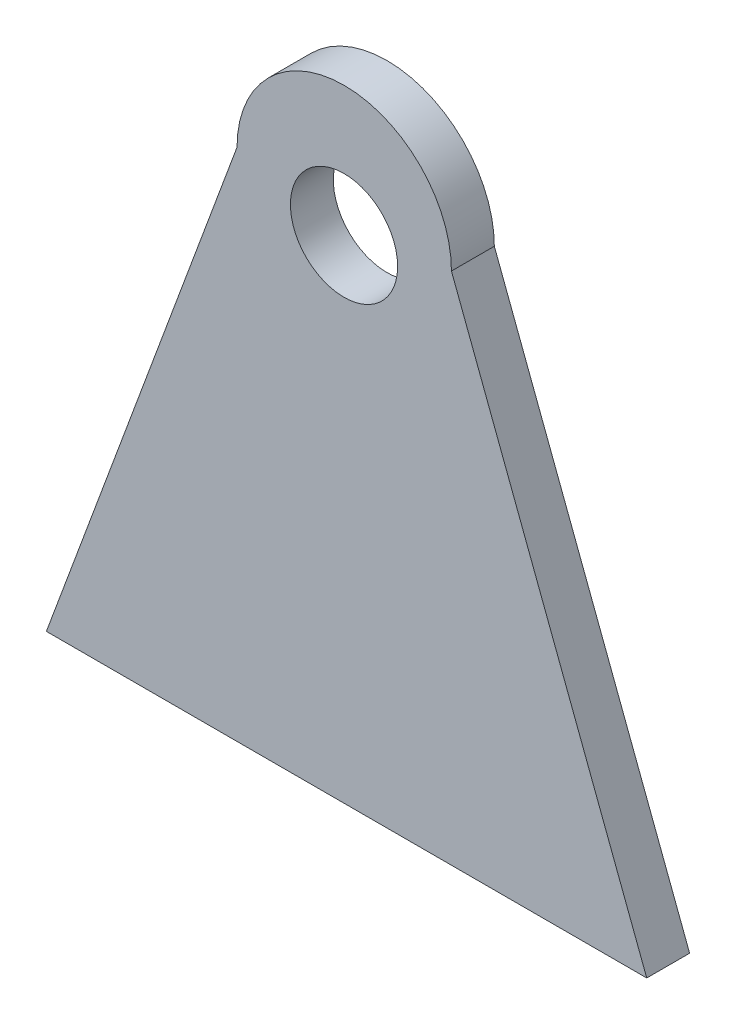
ISO-10303-21;
HEADER;
FILE_DESCRIPTION(('STEP AP214'),'2;1');
FILE_NAME('part.step','',(''),(''),'','','');
FILE_SCHEMA(('AUTOMOTIVE_DESIGN { 1 0 10303 214 1 1 1 1 }'));
ENDSEC;
DATA;
#1=APPLICATION_CONTEXT('core data for automotive mechanical design processes');
#2=APPLICATION_PROTOCOL_DEFINITION('international standard','automotive_design',2000,#1);
#3=PRODUCT_CONTEXT('',#1,'mechanical');
#4=PRODUCT('Part','Part','',(#3));
#5=PRODUCT_RELATED_PRODUCT_CATEGORY('part','',(#4));
#6=PRODUCT_DEFINITION_FORMATION('','',#4);
#7=PRODUCT_DEFINITION_CONTEXT('part definition',#1,'design');
#8=PRODUCT_DEFINITION('design','',#6,#7);
#9=PRODUCT_DEFINITION_SHAPE('','',#8);
#10=(LENGTH_UNIT() NAMED_UNIT(*) SI_UNIT(.MILLI.,.METRE.));
#11=(NAMED_UNIT(*) PLANE_ANGLE_UNIT() SI_UNIT($,.RADIAN.));
#12=(NAMED_UNIT(*) SI_UNIT($,.STERADIAN.) SOLID_ANGLE_UNIT());
#13=UNCERTAINTY_MEASURE_WITH_UNIT(LENGTH_MEASURE(1.E-05),#10,'distance_accuracy_value','');
#14=(GEOMETRIC_REPRESENTATION_CONTEXT(3) GLOBAL_UNCERTAINTY_ASSIGNED_CONTEXT((#13)) GLOBAL_UNIT_ASSIGNED_CONTEXT((#10,
#11,#12)) REPRESENTATION_CONTEXT('',''));
#15=CARTESIAN_POINT('',(0.,0.,0.));
#16=DIRECTION('',(0.,0.,1.));
#17=DIRECTION('',(1.,0.,0.));
#18=AXIS2_PLACEMENT_3D('',#15,#16,#17);
#19=CARTESIAN_POINT('',(244.749065355115,92.885054272632,20.));
#20=DIRECTION('',(0.934935187507507,0.354818538354893,0.));
#21=DIRECTION('',(-0.354818538354893,0.934935187507507,0.));
#22=AXIS2_PLACEMENT_3D('',#19,#20,#21);
#23=PLANE('',#22);
#24=DIRECTION('',(0.354818538354893,-0.934935187507507,0.));
#25=VECTOR('',#24,1.);
#26=CARTESIAN_POINT('',(244.749065355115,92.885054272632,0.));
#27=LINE('',#26,#25);
#28=CARTESIAN_POINT('',(188.917270049278,240.,0.));
#29=VERTEX_POINT('',#28);
#30=CARTESIAN_POINT('',(280.,0.,0.));
#31=VERTEX_POINT('',#30);
#32=EDGE_CURVE('E97',#29,#31,#27,.T.);
#33=ORIENTED_EDGE('',*,*,#32,.F.);
#34=DIRECTION('',(0.,0.,-1.));
#35=VECTOR('',#34,1.);
#36=CARTESIAN_POINT('',(188.917270049278,240.,20.));
#37=LINE('',#36,#35);
#38=CARTESIAN_POINT('',(188.917270049278,240.,20.));
#39=VERTEX_POINT('',#38);
#40=EDGE_CURVE('E11',#39,#29,#37,.T.);
#41=ORIENTED_EDGE('',*,*,#40,.F.);
#42=DIRECTION('',(0.354818538354893,-0.934935187507507,0.));
#43=VECTOR('',#42,1.);
#44=CARTESIAN_POINT('',(244.749065355115,92.885054272632,20.));
#45=LINE('',#44,#43);
#46=CARTESIAN_POINT('',(280.,0.,20.));
#47=VERTEX_POINT('',#46);
#48=EDGE_CURVE('E85',#39,#47,#45,.T.);
#49=ORIENTED_EDGE('',*,*,#48,.T.);
#50=DIRECTION('',(0.,0.,-1.));
#51=VECTOR('',#50,1.);
#52=CARTESIAN_POINT('',(280.,0.,20.));
#53=LINE('',#52,#51);
#54=EDGE_CURVE('E74',#47,#31,#53,.T.);
#55=ORIENTED_EDGE('',*,*,#54,.T.);
#56=EDGE_LOOP('',(#33,#41,#49,#55));
#57=FACE_BOUND('',#56,.T.);
#58=ADVANCED_FACE('F35',(#57),#23,.T.);
#59=CARTESIAN_POINT('',(138.917270049278,240.,20.));
#60=DIRECTION('',(0.,0.,-1.));
#61=DIRECTION('',(-1.,0.,0.));
#62=AXIS2_PLACEMENT_3D('',#59,#60,#61);
#63=CYLINDRICAL_SURFACE('',#62,50.);
#64=CARTESIAN_POINT('',(138.917270049278,240.,0.));
#65=DIRECTION('',(0.,0.,1.));
#66=DIRECTION('',(1.,0.,0.));
#67=AXIS2_PLACEMENT_3D('',#64,#65,#66);
#68=CIRCLE('',#67,50.);
#69=CARTESIAN_POINT('',(88.9172700492776,240.,0.));
#70=VERTEX_POINT('',#69);
#71=EDGE_CURVE('E90',#29,#70,#68,.T.);
#72=ORIENTED_EDGE('',*,*,#71,.T.);
#73=DIRECTION('',(0.,0.,-1.));
#74=VECTOR('',#73,1.);
#75=CARTESIAN_POINT('',(88.9172700492776,240.,20.));
#76=LINE('',#75,#74);
#77=CARTESIAN_POINT('',(88.9172700492776,240.,20.));
#78=VERTEX_POINT('',#77);
#79=EDGE_CURVE('E43',#78,#70,#76,.T.);
#80=ORIENTED_EDGE('',*,*,#79,.F.);
#81=CARTESIAN_POINT('',(138.917270049278,240.,20.));
#82=DIRECTION('',(0.,0.,1.));
#83=DIRECTION('',(1.,0.,0.));
#84=AXIS2_PLACEMENT_3D('',#81,#82,#83);
#85=CIRCLE('',#84,50.);
#86=EDGE_CURVE('E80',#39,#78,#85,.T.);
#87=ORIENTED_EDGE('',*,*,#86,.F.);
#88=ORIENTED_EDGE('',*,*,#40,.T.);
#89=EDGE_LOOP('',(#72,#80,#87,#88));
#90=FACE_BOUND('',#89,.T.);
#91=ADVANCED_FACE('F88',(#90),#63,.T.);
#92=CARTESIAN_POINT('',(0.,0.,20.));
#93=DIRECTION('',(0.937712639797948,-0.347411866756396,0.));
#94=DIRECTION('',(0.347411866756396,0.937712639797948,0.));
#95=AXIS2_PLACEMENT_3D('',#92,#93,#94);
#96=PLANE('',#95);
#97=DIRECTION('',(-0.347411866756396,-0.937712639797948,0.));
#98=VECTOR('',#97,1.);
#99=CARTESIAN_POINT('',(0.,0.,0.));
#100=LINE('',#99,#98);
#101=CARTESIAN_POINT('',(0.,0.,0.));
#102=VERTEX_POINT('',#101);
#103=EDGE_CURVE('E67',#70,#102,#100,.T.);
#104=ORIENTED_EDGE('',*,*,#103,.T.);
#105=DIRECTION('',(0.,0.,-1.));
#106=VECTOR('',#105,1.);
#107=CARTESIAN_POINT('',(0.,0.,20.));
#108=LINE('',#107,#106);
#109=CARTESIAN_POINT('',(0.,0.,20.));
#110=VERTEX_POINT('',#109);
#111=EDGE_CURVE('E91',#110,#102,#108,.T.);
#112=ORIENTED_EDGE('',*,*,#111,.F.);
#113=DIRECTION('',(-0.347411866756396,-0.937712639797948,0.));
#114=VECTOR('',#113,1.);
#115=CARTESIAN_POINT('',(0.,0.,20.));
#116=LINE('',#115,#114);
#117=EDGE_CURVE('E84',#78,#110,#116,.T.);
#118=ORIENTED_EDGE('',*,*,#117,.F.);
#119=ORIENTED_EDGE('',*,*,#79,.T.);
#120=EDGE_LOOP('',(#104,#112,#118,#119));
#121=FACE_BOUND('',#120,.T.);
#122=ADVANCED_FACE('F92',(#121),#96,.F.);
#123=CARTESIAN_POINT('',(0.,0.,20.));
#124=DIRECTION('',(0.,1.,0.));
#125=DIRECTION('',(0.,0.,1.));
#126=AXIS2_PLACEMENT_3D('',#123,#124,#125);
#127=PLANE('',#126);
#128=DIRECTION('',(1.,0.,0.));
#129=VECTOR('',#128,1.);
#130=CARTESIAN_POINT('',(0.,0.,0.));
#131=LINE('',#130,#129);
#132=EDGE_CURVE('E103',#102,#31,#131,.T.);
#133=ORIENTED_EDGE('',*,*,#132,.T.);
#134=ORIENTED_EDGE('',*,*,#54,.F.);
#135=DIRECTION('',(1.,0.,0.));
#136=VECTOR('',#135,1.);
#137=CARTESIAN_POINT('',(0.,0.,20.));
#138=LINE('',#137,#136);
#139=EDGE_CURVE('E51',#110,#47,#138,.T.);
#140=ORIENTED_EDGE('',*,*,#139,.F.);
#141=ORIENTED_EDGE('',*,*,#111,.T.);
#142=EDGE_LOOP('',(#133,#134,#140,#141));
#143=FACE_BOUND('',#142,.T.);
#144=ADVANCED_FACE('F108',(#143),#127,.F.);
#145=CARTESIAN_POINT('',(0.,0.,20.));
#146=DIRECTION('',(0.,0.,1.));
#147=DIRECTION('',(1.,0.,0.));
#148=AXIS2_PLACEMENT_3D('',#145,#146,#147);
#149=PLANE('',#148);
#150=CARTESIAN_POINT('',(138.814767889916,229.349018500945,20.));
#151=DIRECTION('',(0.,0.,1.));
#152=DIRECTION('',(1.,0.,0.));
#153=AXIS2_PLACEMENT_3D('',#150,#151,#152);
#154=CIRCLE('',#153,25.);
#155=CARTESIAN_POINT('',(163.814767889916,229.349018500945,20.));
#156=VERTEX_POINT('',#155);
#157=EDGE_CURVE('E138',#156,#156,#154,.T.);
#158=ORIENTED_EDGE('',*,*,#157,.F.);
#159=EDGE_LOOP('',(#158));
#160=FACE_BOUND('',#159,.T.);
#161=ORIENTED_EDGE('',*,*,#48,.F.);
#162=ORIENTED_EDGE('',*,*,#86,.T.);
#163=ORIENTED_EDGE('',*,*,#117,.T.);
#164=ORIENTED_EDGE('',*,*,#139,.T.);
#165=EDGE_LOOP('',(#161,#162,#163,#164));
#166=FACE_BOUND('',#165,.T.);
#167=ADVANCED_FACE('F82',(#160,#166),#149,.T.);
#168=CARTESIAN_POINT('',(0.,0.,0.));
#169=DIRECTION('',(0.,0.,1.));
#170=DIRECTION('',(1.,0.,0.));
#171=AXIS2_PLACEMENT_3D('',#168,#169,#170);
#172=PLANE('',#171);
#173=CARTESIAN_POINT('',(138.814767889916,229.349018500945,0.));
#174=DIRECTION('',(0.,0.,1.));
#175=DIRECTION('',(1.,0.,0.));
#176=AXIS2_PLACEMENT_3D('',#173,#174,#175);
#177=CIRCLE('',#176,25.);
#178=CARTESIAN_POINT('',(163.814767889916,229.349018500945,0.));
#179=VERTEX_POINT('',#178);
#180=EDGE_CURVE('E100',#179,#179,#177,.T.);
#181=ORIENTED_EDGE('',*,*,#180,.T.);
#182=EDGE_LOOP('',(#181));
#183=FACE_BOUND('',#182,.T.);
#184=ORIENTED_EDGE('',*,*,#32,.T.);
#185=ORIENTED_EDGE('',*,*,#132,.F.);
#186=ORIENTED_EDGE('',*,*,#103,.F.);
#187=ORIENTED_EDGE('',*,*,#71,.F.);
#188=EDGE_LOOP('',(#184,#185,#186,#187));
#189=FACE_BOUND('',#188,.T.);
#190=ADVANCED_FACE('F110',(#183,#189),#172,.F.);
#191=CARTESIAN_POINT('',(138.814767889916,229.349018500945,0.));
#192=DIRECTION('',(0.,0.,1.));
#193=DIRECTION('',(1.,0.,0.));
#194=AXIS2_PLACEMENT_3D('',#191,#192,#193);
#195=CYLINDRICAL_SURFACE('',#194,25.);
#196=ORIENTED_EDGE('',*,*,#180,.F.);
#197=EDGE_LOOP('',(#196));
#198=FACE_BOUND('',#197,.T.);
#199=ORIENTED_EDGE('',*,*,#157,.T.);
#200=EDGE_LOOP('',(#199));
#201=FACE_BOUND('',#200,.T.);
#202=ADVANCED_FACE('F124',(#198,#201),#195,.F.);
#203=CLOSED_SHELL('',(#58,#91,#122,#144,#167,#190,#202));
#204=MANIFOLD_SOLID_BREP('B2',#203);
#205=ADVANCED_BREP_SHAPE_REPRESENTATION('',(#18,#204),#14);
#206=SHAPE_DEFINITION_REPRESENTATION(#9,#205);
ENDSEC;
END-ISO-10303-21;
